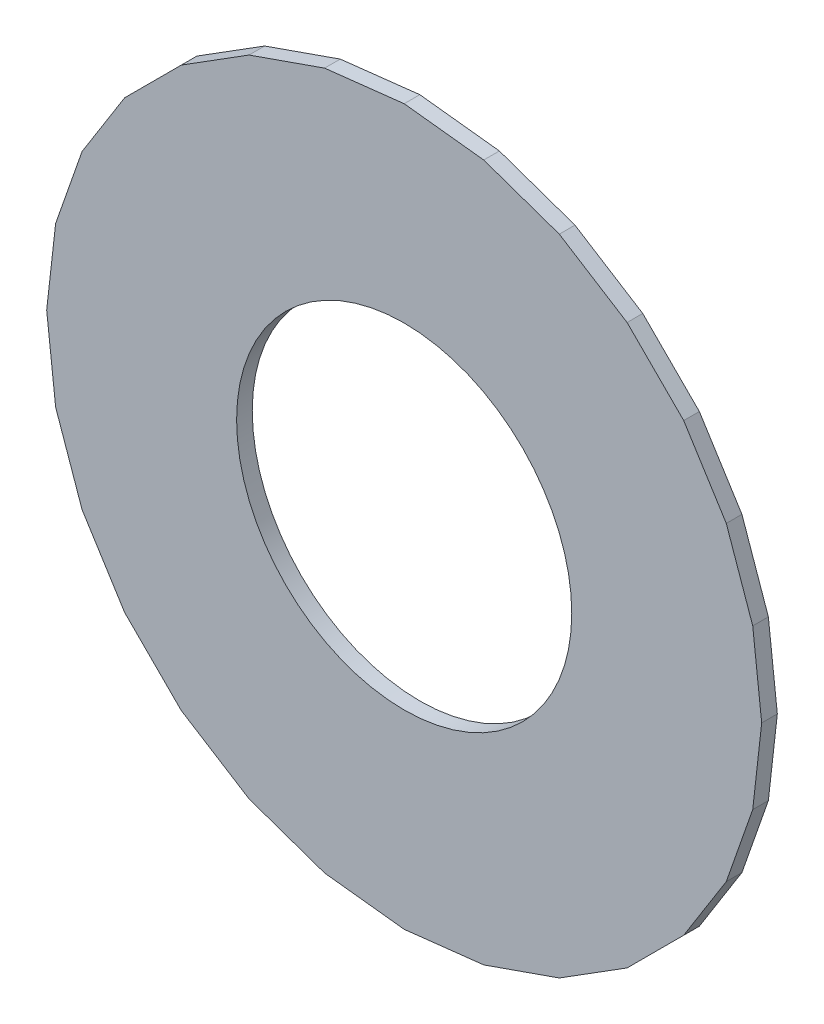
ISO-10303-21;
HEADER;
FILE_DESCRIPTION(('STEP AP214'),'2;1');
FILE_NAME('part.step','',(''),(''),'','','');
FILE_SCHEMA(('AUTOMOTIVE_DESIGN { 1 0 10303 214 1 1 1 1 }'));
ENDSEC;
DATA;
#1=APPLICATION_CONTEXT('core data for automotive mechanical design processes');
#2=APPLICATION_PROTOCOL_DEFINITION('international standard','automotive_design',2000,#1);
#3=PRODUCT_CONTEXT('',#1,'mechanical');
#4=PRODUCT('Part','Part','',(#3));
#5=PRODUCT_RELATED_PRODUCT_CATEGORY('part','',(#4));
#6=PRODUCT_DEFINITION_FORMATION('','',#4);
#7=PRODUCT_DEFINITION_CONTEXT('part definition',#1,'design');
#8=PRODUCT_DEFINITION('design','',#6,#7);
#9=PRODUCT_DEFINITION_SHAPE('','',#8);
#10=(LENGTH_UNIT() NAMED_UNIT(*) SI_UNIT(.MILLI.,.METRE.));
#11=(NAMED_UNIT(*) PLANE_ANGLE_UNIT() SI_UNIT($,.RADIAN.));
#12=(NAMED_UNIT(*) SI_UNIT($,.STERADIAN.) SOLID_ANGLE_UNIT());
#13=UNCERTAINTY_MEASURE_WITH_UNIT(LENGTH_MEASURE(1.E-05),#10,'distance_accuracy_value','');
#14=(GEOMETRIC_REPRESENTATION_CONTEXT(3) GLOBAL_UNCERTAINTY_ASSIGNED_CONTEXT((#13)) GLOBAL_UNIT_ASSIGNED_CONTEXT((#10,
#11,#12)) REPRESENTATION_CONTEXT('',''));
#15=CARTESIAN_POINT('',(0.,0.,0.));
#16=DIRECTION('',(0.,0.,1.));
#17=DIRECTION('',(1.,0.,0.));
#18=AXIS2_PLACEMENT_3D('',#15,#16,#17);
#19=CARTESIAN_POINT('',(165.608,-76.2,-0.045));
#20=DIRECTION('',(0.,0.,-1.));
#21=DIRECTION('',(0.,-1.,0.));
#22=AXIS2_PLACEMENT_3D('',#19,#20,#21);
#23=CYLINDRICAL_SURFACE('',#22,0.375);
#24=CARTESIAN_POINT('',(165.608,-76.2,1.67));
#25=DIRECTION('',(0.,0.,-1.));
#26=DIRECTION('',(0.,-1.,0.));
#27=AXIS2_PLACEMENT_3D('',#24,#25,#26);
#28=CIRCLE('',#27,0.375);
#29=CARTESIAN_POINT('',(165.608,-76.575,1.67));
#30=VERTEX_POINT('',#29);
#31=EDGE_CURVE('E316',#30,#30,#28,.T.);
#32=ORIENTED_EDGE('',*,*,#31,.T.);
#33=DIRECTION('',(0.,0.,1.));
#34=VECTOR('',#33,1.);
#35=CARTESIAN_POINT('',(165.608,-76.575,-0.045));
#36=LINE('',#35,#34);
#37=CARTESIAN_POINT('',(165.608,-76.575,1.705));
#38=VERTEX_POINT('',#37);
#39=EDGE_CURVE('E10',#30,#38,#36,.T.);
#40=ORIENTED_EDGE('',*,*,#39,.T.);
#41=CARTESIAN_POINT('',(165.608,-76.2,1.705));
#42=DIRECTION('',(0.,0.,-1.));
#43=DIRECTION('',(0.,-1.,0.));
#44=AXIS2_PLACEMENT_3D('',#41,#42,#43);
#45=CIRCLE('',#44,0.375);
#46=EDGE_CURVE('E283',#38,#38,#45,.T.);
#47=ORIENTED_EDGE('',*,*,#46,.F.);
#48=ORIENTED_EDGE('',*,*,#39,.F.);
#49=EDGE_LOOP('',(#32,#40,#47,#48));
#50=FACE_BOUND('',#49,.T.);
#51=ADVANCED_FACE('F16',(#50),#23,.F.);
#52=CARTESIAN_POINT('',(165.429983,-76.979942,1.67));
#53=DIRECTION('',(-0.330278315977027,-0.943883591337077,0.));
#54=DIRECTION('',(-0.943883591337077,0.330278315977027,0.));
#55=AXIS2_PLACEMENT_3D('',#52,#53,#54);
#56=PLANE('',#55);
#57=DIRECTION('',(0.,0.,1.));
#58=VECTOR('',#57,1.);
#59=CARTESIAN_POINT('',(165.429983,-76.979942,1.67));
#60=LINE('',#59,#58);
#61=CARTESIAN_POINT('',(165.429983,-76.979942,1.67));
#62=VERTEX_POINT('',#61);
#63=CARTESIAN_POINT('',(165.429983,-76.979942,1.705));
#64=VERTEX_POINT('',#63);
#65=EDGE_CURVE('E25',#62,#64,#60,.T.);
#66=ORIENTED_EDGE('',*,*,#65,.T.);
#67=DIRECTION('',(-0.943883591337077,0.330278315977027,0.));
#68=VECTOR('',#67,1.);
#69=CARTESIAN_POINT('',(165.429983,-76.979942,1.705));
#70=LINE('',#69,#68);
#71=CARTESIAN_POINT('',(165.260893,-76.920775,1.705));
#72=VERTEX_POINT('',#71);
#73=EDGE_CURVE('E330',#64,#72,#70,.T.);
#74=ORIENTED_EDGE('',*,*,#73,.T.);
#75=DIRECTION('',(0.,0.,1.));
#76=VECTOR('',#75,1.);
#77=CARTESIAN_POINT('',(165.260893,-76.920775,1.67));
#78=LINE('',#77,#76);
#79=CARTESIAN_POINT('',(165.260893,-76.920775,1.67));
#80=VERTEX_POINT('',#79);
#81=EDGE_CURVE('E19',#80,#72,#78,.T.);
#82=ORIENTED_EDGE('',*,*,#81,.F.);
#83=DIRECTION('',(-0.943883591337077,0.330278315977027,0.));
#84=VECTOR('',#83,1.);
#85=CARTESIAN_POINT('',(165.429983,-76.979942,1.67));
#86=LINE('',#85,#84);
#87=EDGE_CURVE('E420',#62,#80,#86,.T.);
#88=ORIENTED_EDGE('',*,*,#87,.F.);
#89=EDGE_LOOP('',(#66,#74,#82,#88));
#90=FACE_BOUND('',#89,.T.);
#91=ADVANCED_FACE('F880',(#90),#56,.T.);
#92=CARTESIAN_POINT('',(165.608,-77.,1.67));
#93=DIRECTION('',(-0.111966136678988,-0.993712022789894,0.));
#94=DIRECTION('',(-0.993712022789894,0.111966136678988,0.));
#95=AXIS2_PLACEMENT_3D('',#92,#93,#94);
#96=PLANE('',#95);
#97=DIRECTION('',(0.,0.,1.));
#98=VECTOR('',#97,1.);
#99=CARTESIAN_POINT('',(165.608,-77.,1.67));
#100=LINE('',#99,#98);
#101=CARTESIAN_POINT('',(165.608,-77.,1.67));
#102=VERTEX_POINT('',#101);
#103=CARTESIAN_POINT('',(165.608,-77.,1.705));
#104=VERTEX_POINT('',#103);
#105=EDGE_CURVE('E567',#102,#104,#100,.T.);
#106=ORIENTED_EDGE('',*,*,#105,.T.);
#107=DIRECTION('',(-0.993712022789894,0.111966136678988,0.));
#108=VECTOR('',#107,1.);
#109=CARTESIAN_POINT('',(165.608,-77.,1.705));
#110=LINE('',#109,#108);
#111=EDGE_CURVE('E480',#104,#64,#110,.T.);
#112=ORIENTED_EDGE('',*,*,#111,.T.);
#113=ORIENTED_EDGE('',*,*,#65,.F.);
#114=DIRECTION('',(-0.993712022789894,0.111966136678988,0.));
#115=VECTOR('',#114,1.);
#116=CARTESIAN_POINT('',(165.608,-77.,1.67));
#117=LINE('',#116,#115);
#118=EDGE_CURVE('E416',#102,#62,#117,.T.);
#119=ORIENTED_EDGE('',*,*,#118,.F.);
#120=EDGE_LOOP('',(#106,#112,#113,#119));
#121=FACE_BOUND('',#120,.T.);
#122=ADVANCED_FACE('F885',(#121),#96,.T.);
#123=CARTESIAN_POINT('',(165.260893,-76.920775,1.67));
#124=DIRECTION('',(-0.532032066600227,-0.846724205458361,0.));
#125=DIRECTION('',(-0.846724205458361,0.532032066600227,0.));
#126=AXIS2_PLACEMENT_3D('',#123,#124,#125);
#127=PLANE('',#126);
#128=ORIENTED_EDGE('',*,*,#81,.T.);
#129=DIRECTION('',(-0.846724205458361,0.532032066600227,0.));
#130=VECTOR('',#129,1.);
#131=CARTESIAN_POINT('',(165.260893,-76.920775,1.705));
#132=LINE('',#131,#130);
#133=CARTESIAN_POINT('',(165.109208,-76.825465,1.705));
#134=VERTEX_POINT('',#133);
#135=EDGE_CURVE('E326',#72,#134,#132,.T.);
#136=ORIENTED_EDGE('',*,*,#135,.T.);
#137=DIRECTION('',(0.,0.,1.));
#138=VECTOR('',#137,1.);
#139=CARTESIAN_POINT('',(165.109208,-76.825465,1.67));
#140=LINE('',#139,#138);
#141=CARTESIAN_POINT('',(165.109208,-76.825465,1.67));
#142=VERTEX_POINT('',#141);
#143=EDGE_CURVE('E570',#142,#134,#140,.T.);
#144=ORIENTED_EDGE('',*,*,#143,.F.);
#145=DIRECTION('',(-0.846724205458361,0.532032066600227,0.));
#146=VECTOR('',#145,1.);
#147=CARTESIAN_POINT('',(165.260893,-76.920775,1.67));
#148=LINE('',#147,#146);
#149=EDGE_CURVE('E430',#80,#142,#148,.T.);
#150=ORIENTED_EDGE('',*,*,#149,.F.);
#151=EDGE_LOOP('',(#128,#136,#144,#150));
#152=FACE_BOUND('',#151,.T.);
#153=ADVANCED_FACE('F587',(#152),#127,.T.);
#154=CARTESIAN_POINT('',(165.786017,-76.979942,1.67));
#155=DIRECTION('',(0.111966136678988,-0.993712022789894,0.));
#156=DIRECTION('',(0.,0.,-1.));
#157=AXIS2_PLACEMENT_3D('',#154,#155,#156);
#158=PLANE('',#157);
#159=DIRECTION('',(0.,0.,1.));
#160=VECTOR('',#159,1.);
#161=CARTESIAN_POINT('',(165.786017,-76.979942,1.67));
#162=LINE('',#161,#160);
#163=CARTESIAN_POINT('',(165.786017,-76.979942,1.67));
#164=VERTEX_POINT('',#163);
#165=CARTESIAN_POINT('',(165.786017,-76.979942,1.705));
#166=VERTEX_POINT('',#165);
#167=EDGE_CURVE('E573',#164,#166,#162,.T.);
#168=ORIENTED_EDGE('',*,*,#167,.T.);
#169=DIRECTION('',(-0.993712022789894,-0.111966136678988,0.));
#170=VECTOR('',#169,1.);
#171=CARTESIAN_POINT('',(165.786017,-76.979942,1.705));
#172=LINE('',#171,#170);
#173=EDGE_CURVE('E476',#166,#104,#172,.T.);
#174=ORIENTED_EDGE('',*,*,#173,.T.);
#175=ORIENTED_EDGE('',*,*,#105,.F.);
#176=DIRECTION('',(-0.993712022789894,-0.111966136678988,0.));
#177=VECTOR('',#176,1.);
#178=CARTESIAN_POINT('',(165.786017,-76.979942,1.67));
#179=LINE('',#178,#177);
#180=EDGE_CURVE('E412',#164,#102,#179,.T.);
#181=ORIENTED_EDGE('',*,*,#180,.F.);
#182=EDGE_LOOP('',(#168,#174,#175,#181));
#183=FACE_BOUND('',#182,.T.);
#184=ADVANCED_FACE('F1105',(#183),#158,.T.);
#185=CARTESIAN_POINT('',(165.109208,-76.825465,1.67));
#186=DIRECTION('',(-0.707106781186548,-0.707106781186548,0.));
#187=DIRECTION('',(-0.707106781186548,0.707106781186548,0.));
#188=AXIS2_PLACEMENT_3D('',#185,#186,#187);
#189=PLANE('',#188);
#190=ORIENTED_EDGE('',*,*,#143,.T.);
#191=DIRECTION('',(-0.707106781186548,0.707106781186548,0.));
#192=VECTOR('',#191,1.);
#193=CARTESIAN_POINT('',(165.109208,-76.825465,1.705));
#194=LINE('',#193,#192);
#195=CARTESIAN_POINT('',(164.982535,-76.698792,1.705));
#196=VERTEX_POINT('',#195);
#197=EDGE_CURVE('E331',#134,#196,#194,.T.);
#198=ORIENTED_EDGE('',*,*,#197,.T.);
#199=DIRECTION('',(0.,0.,1.));
#200=VECTOR('',#199,1.);
#201=CARTESIAN_POINT('',(164.982535,-76.698792,1.67));
#202=LINE('',#201,#200);
#203=CARTESIAN_POINT('',(164.982535,-76.698792,1.67));
#204=VERTEX_POINT('',#203);
#205=EDGE_CURVE('E566',#204,#196,#202,.T.);
#206=ORIENTED_EDGE('',*,*,#205,.F.);
#207=DIRECTION('',(-0.707106781186548,0.707106781186548,0.));
#208=VECTOR('',#207,1.);
#209=CARTESIAN_POINT('',(165.109208,-76.825465,1.67));
#210=LINE('',#209,#208);
#211=EDGE_CURVE('E310',#142,#204,#210,.T.);
#212=ORIENTED_EDGE('',*,*,#211,.F.);
#213=EDGE_LOOP('',(#190,#198,#206,#212));
#214=FACE_BOUND('',#213,.T.);
#215=ADVANCED_FACE('F580',(#214),#189,.T.);
#216=CARTESIAN_POINT('',(165.955107,-76.920775,1.67));
#217=DIRECTION('',(0.330278315977027,-0.943883591337077,0.));
#218=DIRECTION('',(0.,0.,-1.));
#219=AXIS2_PLACEMENT_3D('',#216,#217,#218);
#220=PLANE('',#219);
#221=DIRECTION('',(0.,0.,1.));
#222=VECTOR('',#221,1.);
#223=CARTESIAN_POINT('',(165.955107,-76.920775,1.67));
#224=LINE('',#223,#222);
#225=CARTESIAN_POINT('',(165.955107,-76.920775,1.67));
#226=VERTEX_POINT('',#225);
#227=CARTESIAN_POINT('',(165.955107,-76.920775,1.705));
#228=VERTEX_POINT('',#227);
#229=EDGE_CURVE('E563',#226,#228,#224,.T.);
#230=ORIENTED_EDGE('',*,*,#229,.T.);
#231=DIRECTION('',(-0.943883591337077,-0.330278315977027,0.));
#232=VECTOR('',#231,1.);
#233=CARTESIAN_POINT('',(165.955107,-76.920775,1.705));
#234=LINE('',#233,#232);
#235=EDGE_CURVE('E346',#228,#166,#234,.T.);
#236=ORIENTED_EDGE('',*,*,#235,.T.);
#237=ORIENTED_EDGE('',*,*,#167,.F.);
#238=DIRECTION('',(-0.943883591337077,-0.330278315977027,0.));
#239=VECTOR('',#238,1.);
#240=CARTESIAN_POINT('',(165.955107,-76.920775,1.67));
#241=LINE('',#240,#239);
#242=EDGE_CURVE('E405',#226,#164,#241,.T.);
#243=ORIENTED_EDGE('',*,*,#242,.F.);
#244=EDGE_LOOP('',(#230,#236,#237,#243));
#245=FACE_BOUND('',#244,.T.);
#246=ADVANCED_FACE('F1090',(#245),#220,.T.);
#247=CARTESIAN_POINT('',(164.982535,-76.698792,1.67));
#248=DIRECTION('',(-0.846724205458361,-0.532032066600227,0.));
#249=DIRECTION('',(-0.532032066600227,0.846724205458361,0.));
#250=AXIS2_PLACEMENT_3D('',#247,#248,#249);
#251=PLANE('',#250);
#252=ORIENTED_EDGE('',*,*,#205,.T.);
#253=DIRECTION('',(-0.532032066600227,0.846724205458361,0.));
#254=VECTOR('',#253,1.);
#255=CARTESIAN_POINT('',(164.982535,-76.698792,1.705));
#256=LINE('',#255,#254);
#257=CARTESIAN_POINT('',(164.887225,-76.547107,1.705));
#258=VERTEX_POINT('',#257);
#259=EDGE_CURVE('E491',#196,#258,#256,.T.);
#260=ORIENTED_EDGE('',*,*,#259,.T.);
#261=DIRECTION('',(0.,0.,1.));
#262=VECTOR('',#261,1.);
#263=CARTESIAN_POINT('',(164.887225,-76.547107,1.67));
#264=LINE('',#263,#262);
#265=CARTESIAN_POINT('',(164.887225,-76.547107,1.67));
#266=VERTEX_POINT('',#265);
#267=EDGE_CURVE('E560',#266,#258,#264,.T.);
#268=ORIENTED_EDGE('',*,*,#267,.F.);
#269=DIRECTION('',(-0.532032066600227,0.846724205458361,0.));
#270=VECTOR('',#269,1.);
#271=CARTESIAN_POINT('',(164.982535,-76.698792,1.67));
#272=LINE('',#271,#270);
#273=EDGE_CURVE('E441',#204,#266,#272,.T.);
#274=ORIENTED_EDGE('',*,*,#273,.F.);
#275=EDGE_LOOP('',(#252,#260,#268,#274));
#276=FACE_BOUND('',#275,.T.);
#277=ADVANCED_FACE('F592',(#276),#251,.T.);
#278=CARTESIAN_POINT('',(166.106792,-76.825465,1.67));
#279=DIRECTION('',(0.532032066600227,-0.846724205458361,0.));
#280=DIRECTION('',(0.,0.,-1.));
#281=AXIS2_PLACEMENT_3D('',#278,#279,#280);
#282=PLANE('',#281);
#283=DIRECTION('',(0.,0.,1.));
#284=VECTOR('',#283,1.);
#285=CARTESIAN_POINT('',(166.106792,-76.825465,1.67));
#286=LINE('',#285,#284);
#287=CARTESIAN_POINT('',(166.106792,-76.825465,1.67));
#288=VERTEX_POINT('',#287);
#289=CARTESIAN_POINT('',(166.106792,-76.825465,1.705));
#290=VERTEX_POINT('',#289);
#291=EDGE_CURVE('E559',#288,#290,#286,.T.);
#292=ORIENTED_EDGE('',*,*,#291,.T.);
#293=DIRECTION('',(-0.846724205458361,-0.532032066600227,0.));
#294=VECTOR('',#293,1.);
#295=CARTESIAN_POINT('',(166.106792,-76.825465,1.705));
#296=LINE('',#295,#294);
#297=EDGE_CURVE('E341',#290,#228,#296,.T.);
#298=ORIENTED_EDGE('',*,*,#297,.T.);
#299=ORIENTED_EDGE('',*,*,#229,.F.);
#300=DIRECTION('',(-0.846724205458361,-0.532032066600227,0.));
#301=VECTOR('',#300,1.);
#302=CARTESIAN_POINT('',(166.106792,-76.825465,1.67));
#303=LINE('',#302,#301);
#304=EDGE_CURVE('E401',#288,#226,#303,.T.);
#305=ORIENTED_EDGE('',*,*,#304,.F.);
#306=EDGE_LOOP('',(#292,#298,#299,#305));
#307=FACE_BOUND('',#306,.T.);
#308=ADVANCED_FACE('F866',(#307),#282,.T.);
#309=CARTESIAN_POINT('',(164.887225,-76.547107,1.67));
#310=DIRECTION('',(-0.943883591337077,-0.330278315977027,0.));
#311=DIRECTION('',(-0.330278315977027,0.943883591337077,0.));
#312=AXIS2_PLACEMENT_3D('',#309,#310,#311);
#313=PLANE('',#312);
#314=ORIENTED_EDGE('',*,*,#267,.T.);
#315=DIRECTION('',(-0.330278315977027,0.943883591337077,0.));
#316=VECTOR('',#315,1.);
#317=CARTESIAN_POINT('',(164.887225,-76.547107,1.705));
#318=LINE('',#317,#316);
#319=CARTESIAN_POINT('',(164.828058,-76.378017,1.705));
#320=VERTEX_POINT('',#319);
#321=EDGE_CURVE('E390',#258,#320,#318,.T.);
#322=ORIENTED_EDGE('',*,*,#321,.T.);
#323=DIRECTION('',(0.,0.,1.));
#324=VECTOR('',#323,1.);
#325=CARTESIAN_POINT('',(164.828058,-76.378017,1.67));
#326=LINE('',#325,#324);
#327=CARTESIAN_POINT('',(164.828058,-76.378017,1.67));
#328=VERTEX_POINT('',#327);
#329=EDGE_CURVE('E556',#328,#320,#326,.T.);
#330=ORIENTED_EDGE('',*,*,#329,.F.);
#331=DIRECTION('',(-0.330278315977027,0.943883591337077,0.));
#332=VECTOR('',#331,1.);
#333=CARTESIAN_POINT('',(164.887225,-76.547107,1.67));
#334=LINE('',#333,#332);
#335=EDGE_CURVE('E445',#266,#328,#334,.T.);
#336=ORIENTED_EDGE('',*,*,#335,.F.);
#337=EDGE_LOOP('',(#314,#322,#330,#336));
#338=FACE_BOUND('',#337,.T.);
#339=ADVANCED_FACE('F863',(#338),#313,.T.);
#340=CARTESIAN_POINT('',(166.233465,-76.698792,1.67));
#341=DIRECTION('',(0.707106781186548,-0.707106781186548,0.));
#342=DIRECTION('',(0.,0.,-1.));
#343=AXIS2_PLACEMENT_3D('',#340,#341,#342);
#344=PLANE('',#343);
#345=DIRECTION('',(0.,0.,1.));
#346=VECTOR('',#345,1.);
#347=CARTESIAN_POINT('',(166.233465,-76.698792,1.67));
#348=LINE('',#347,#346);
#349=CARTESIAN_POINT('',(166.233465,-76.698792,1.67));
#350=VERTEX_POINT('',#349);
#351=CARTESIAN_POINT('',(166.233465,-76.698792,1.705));
#352=VERTEX_POINT('',#351);
#353=EDGE_CURVE('E553',#350,#352,#348,.T.);
#354=ORIENTED_EDGE('',*,*,#353,.T.);
#355=DIRECTION('',(-0.707106781186548,-0.707106781186548,0.));
#356=VECTOR('',#355,1.);
#357=CARTESIAN_POINT('',(166.233465,-76.698792,1.705));
#358=LINE('',#357,#356);
#359=EDGE_CURVE('E345',#352,#290,#358,.T.);
#360=ORIENTED_EDGE('',*,*,#359,.T.);
#361=ORIENTED_EDGE('',*,*,#291,.F.);
#362=DIRECTION('',(-0.707106781186548,-0.707106781186548,0.));
#363=VECTOR('',#362,1.);
#364=CARTESIAN_POINT('',(166.233465,-76.698792,1.67));
#365=LINE('',#364,#363);
#366=EDGE_CURVE('E385',#350,#288,#365,.T.);
#367=ORIENTED_EDGE('',*,*,#366,.F.);
#368=EDGE_LOOP('',(#354,#360,#361,#367));
#369=FACE_BOUND('',#368,.T.);
#370=ADVANCED_FACE('F865',(#369),#344,.T.);
#371=CARTESIAN_POINT('',(164.828058,-76.378017,1.67));
#372=DIRECTION('',(-0.993712022789894,-0.111966136678988,0.));
#373=DIRECTION('',(-0.111966136678988,0.993712022789894,0.));
#374=AXIS2_PLACEMENT_3D('',#371,#372,#373);
#375=PLANE('',#374);
#376=ORIENTED_EDGE('',*,*,#329,.T.);
#377=DIRECTION('',(-0.111966136678988,0.993712022789894,0.));
#378=VECTOR('',#377,1.);
#379=CARTESIAN_POINT('',(164.828058,-76.378017,1.705));
#380=LINE('',#379,#378);
#381=CARTESIAN_POINT('',(164.808,-76.2,1.705));
#382=VERTEX_POINT('',#381);
#383=EDGE_CURVE('E386',#320,#382,#380,.T.);
#384=ORIENTED_EDGE('',*,*,#383,.T.);
#385=DIRECTION('',(0.,0.,1.));
#386=VECTOR('',#385,1.);
#387=CARTESIAN_POINT('',(164.808,-76.2,1.67));
#388=LINE('',#387,#386);
#389=CARTESIAN_POINT('',(164.808,-76.2,1.67));
#390=VERTEX_POINT('',#389);
#391=EDGE_CURVE('E423',#390,#382,#388,.T.);
#392=ORIENTED_EDGE('',*,*,#391,.F.);
#393=DIRECTION('',(-0.111966136678988,0.993712022789894,0.));
#394=VECTOR('',#393,1.);
#395=CARTESIAN_POINT('',(164.828058,-76.378017,1.67));
#396=LINE('',#395,#394);
#397=EDGE_CURVE('E446',#328,#390,#396,.T.);
#398=ORIENTED_EDGE('',*,*,#397,.F.);
#399=EDGE_LOOP('',(#376,#384,#392,#398));
#400=FACE_BOUND('',#399,.T.);
#401=ADVANCED_FACE('F861',(#400),#375,.T.);
#402=CARTESIAN_POINT('',(166.328775,-76.547107,1.67));
#403=DIRECTION('',(0.846724205458361,-0.532032066600227,0.));
#404=DIRECTION('',(0.,0.,-1.));
#405=AXIS2_PLACEMENT_3D('',#402,#403,#404);
#406=PLANE('',#405);
#407=DIRECTION('',(0.,0.,1.));
#408=VECTOR('',#407,1.);
#409=CARTESIAN_POINT('',(166.328775,-76.547107,1.67));
#410=LINE('',#409,#408);
#411=CARTESIAN_POINT('',(166.328775,-76.547107,1.67));
#412=VERTEX_POINT('',#411);
#413=CARTESIAN_POINT('',(166.328775,-76.547107,1.705));
#414=VERTEX_POINT('',#413);
#415=EDGE_CURVE('E408',#412,#414,#410,.T.);
#416=ORIENTED_EDGE('',*,*,#415,.T.);
#417=DIRECTION('',(-0.532032066600227,-0.846724205458361,0.));
#418=VECTOR('',#417,1.);
#419=CARTESIAN_POINT('',(166.328775,-76.547107,1.705));
#420=LINE('',#419,#418);
#421=EDGE_CURVE('E516',#414,#352,#420,.T.);
#422=ORIENTED_EDGE('',*,*,#421,.T.);
#423=ORIENTED_EDGE('',*,*,#353,.F.);
#424=DIRECTION('',(-0.532032066600227,-0.846724205458361,0.));
#425=VECTOR('',#424,1.);
#426=CARTESIAN_POINT('',(166.328775,-76.547107,1.67));
#427=LINE('',#426,#425);
#428=EDGE_CURVE('E355',#412,#350,#427,.T.);
#429=ORIENTED_EDGE('',*,*,#428,.F.);
#430=EDGE_LOOP('',(#416,#422,#423,#429));
#431=FACE_BOUND('',#430,.T.);
#432=ADVANCED_FACE('F943',(#431),#406,.T.);
#433=CARTESIAN_POINT('',(164.808,-76.2,1.67));
#434=DIRECTION('',(-0.993712022789894,0.111966136678988,0.));
#435=DIRECTION('',(0.,0.,1.));
#436=AXIS2_PLACEMENT_3D('',#433,#434,#435);
#437=PLANE('',#436);
#438=ORIENTED_EDGE('',*,*,#391,.T.);
#439=DIRECTION('',(0.111966136678988,0.993712022789894,0.));
#440=VECTOR('',#439,1.);
#441=CARTESIAN_POINT('',(164.808,-76.2,1.705));
#442=LINE('',#441,#440);
#443=CARTESIAN_POINT('',(164.828058,-76.021983,1.705));
#444=VERTEX_POINT('',#443);
#445=EDGE_CURVE('E391',#382,#444,#442,.T.);
#446=ORIENTED_EDGE('',*,*,#445,.T.);
#447=DIRECTION('',(0.,0.,1.));
#448=VECTOR('',#447,1.);
#449=CARTESIAN_POINT('',(164.828058,-76.021983,1.67));
#450=LINE('',#449,#448);
#451=CARTESIAN_POINT('',(164.828058,-76.021983,1.67));
#452=VERTEX_POINT('',#451);
#453=EDGE_CURVE('E324',#452,#444,#450,.T.);
#454=ORIENTED_EDGE('',*,*,#453,.F.);
#455=DIRECTION('',(0.111966136678988,0.993712022789894,0.));
#456=VECTOR('',#455,1.);
#457=CARTESIAN_POINT('',(164.808,-76.2,1.67));
#458=LINE('',#457,#456);
#459=EDGE_CURVE('E450',#390,#452,#458,.T.);
#460=ORIENTED_EDGE('',*,*,#459,.F.);
#461=EDGE_LOOP('',(#438,#446,#454,#460));
#462=FACE_BOUND('',#461,.T.);
#463=ADVANCED_FACE('F858',(#462),#437,.T.);
#464=CARTESIAN_POINT('',(166.387942,-76.378017,1.67));
#465=DIRECTION('',(0.943883591337077,-0.330278315977027,0.));
#466=DIRECTION('',(0.,0.,-1.));
#467=AXIS2_PLACEMENT_3D('',#464,#465,#466);
#468=PLANE('',#467);
#469=DIRECTION('',(0.,0.,1.));
#470=VECTOR('',#469,1.);
#471=CARTESIAN_POINT('',(166.387942,-76.378017,1.67));
#472=LINE('',#471,#470);
#473=CARTESIAN_POINT('',(166.387942,-76.378017,1.67));
#474=VERTEX_POINT('',#473);
#475=CARTESIAN_POINT('',(166.387942,-76.378017,1.705));
#476=VERTEX_POINT('',#475);
#477=EDGE_CURVE('E321',#474,#476,#472,.T.);
#478=ORIENTED_EDGE('',*,*,#477,.T.);
#479=DIRECTION('',(-0.330278315977027,-0.943883591337077,0.));
#480=VECTOR('',#479,1.);
#481=CARTESIAN_POINT('',(166.387942,-76.378017,1.705));
#482=LINE('',#481,#480);
#483=EDGE_CURVE('E520',#476,#414,#482,.T.);
#484=ORIENTED_EDGE('',*,*,#483,.T.);
#485=ORIENTED_EDGE('',*,*,#415,.F.);
#486=DIRECTION('',(-0.330278315977027,-0.943883591337077,0.));
#487=VECTOR('',#486,1.);
#488=CARTESIAN_POINT('',(166.387942,-76.378017,1.67));
#489=LINE('',#488,#487);
#490=EDGE_CURVE('E351',#474,#412,#489,.T.);
#491=ORIENTED_EDGE('',*,*,#490,.F.);
#492=EDGE_LOOP('',(#478,#484,#485,#491));
#493=FACE_BOUND('',#492,.T.);
#494=ADVANCED_FACE('F908',(#493),#468,.T.);
#495=CARTESIAN_POINT('',(164.828058,-76.021983,1.67));
#496=DIRECTION('',(-0.943883591337077,0.330278315977027,0.));
#497=DIRECTION('',(0.,0.,1.));
#498=AXIS2_PLACEMENT_3D('',#495,#496,#497);
#499=PLANE('',#498);
#500=ORIENTED_EDGE('',*,*,#453,.T.);
#501=DIRECTION('',(0.330278315977027,0.943883591337077,0.));
#502=VECTOR('',#501,1.);
#503=CARTESIAN_POINT('',(164.828058,-76.021983,1.705));
#504=LINE('',#503,#502);
#505=CARTESIAN_POINT('',(164.887225,-75.852893,1.705));
#506=VERTEX_POINT('',#505);
#507=EDGE_CURVE('E481',#444,#506,#504,.T.);
#508=ORIENTED_EDGE('',*,*,#507,.T.);
#509=DIRECTION('',(0.,0.,1.));
#510=VECTOR('',#509,1.);
#511=CARTESIAN_POINT('',(164.887225,-75.852893,1.67));
#512=LINE('',#511,#510);
#513=CARTESIAN_POINT('',(164.887225,-75.852893,1.67));
#514=VERTEX_POINT('',#513);
#515=EDGE_CURVE('E325',#514,#506,#512,.T.);
#516=ORIENTED_EDGE('',*,*,#515,.F.);
#517=DIRECTION('',(0.330278315977027,0.943883591337077,0.));
#518=VECTOR('',#517,1.);
#519=CARTESIAN_POINT('',(164.828058,-76.021983,1.67));
#520=LINE('',#519,#518);
#521=EDGE_CURVE('E397',#452,#514,#520,.T.);
#522=ORIENTED_EDGE('',*,*,#521,.F.);
#523=EDGE_LOOP('',(#500,#508,#516,#522));
#524=FACE_BOUND('',#523,.T.);
#525=ADVANCED_FACE('F855',(#524),#499,.T.);
#526=CARTESIAN_POINT('',(166.408,-76.2,1.67));
#527=DIRECTION('',(0.993712022789894,-0.111966136678988,0.));
#528=DIRECTION('',(0.,0.,-1.));
#529=AXIS2_PLACEMENT_3D('',#526,#527,#528);
#530=PLANE('',#529);
#531=DIRECTION('',(0.,0.,1.));
#532=VECTOR('',#531,1.);
#533=CARTESIAN_POINT('',(166.408,-76.2,1.67));
#534=LINE('',#533,#532);
#535=CARTESIAN_POINT('',(166.408,-76.2,1.67));
#536=VERTEX_POINT('',#535);
#537=CARTESIAN_POINT('',(166.408,-76.2,1.705));
#538=VERTEX_POINT('',#537);
#539=EDGE_CURVE('E498',#536,#538,#534,.T.);
#540=ORIENTED_EDGE('',*,*,#539,.T.);
#541=DIRECTION('',(-0.111966136678988,-0.993712022789894,0.));
#542=VECTOR('',#541,1.);
#543=CARTESIAN_POINT('',(166.408,-76.2,1.705));
#544=LINE('',#543,#542);
#545=EDGE_CURVE('E524',#538,#476,#544,.T.);
#546=ORIENTED_EDGE('',*,*,#545,.T.);
#547=ORIENTED_EDGE('',*,*,#477,.F.);
#548=DIRECTION('',(-0.111966136678988,-0.993712022789894,0.));
#549=VECTOR('',#548,1.);
#550=CARTESIAN_POINT('',(166.408,-76.2,1.67));
#551=LINE('',#550,#549);
#552=EDGE_CURVE('E356',#536,#474,#551,.T.);
#553=ORIENTED_EDGE('',*,*,#552,.F.);
#554=EDGE_LOOP('',(#540,#546,#547,#553));
#555=FACE_BOUND('',#554,.T.);
#556=ADVANCED_FACE('F907',(#555),#530,.T.);
#557=CARTESIAN_POINT('',(164.887225,-75.852893,1.67));
#558=DIRECTION('',(-0.846724205458361,0.532032066600227,0.));
#559=DIRECTION('',(0.,0.,1.));
#560=AXIS2_PLACEMENT_3D('',#557,#558,#559);
#561=PLANE('',#560);
#562=ORIENTED_EDGE('',*,*,#515,.T.);
#563=DIRECTION('',(0.532032066600227,0.846724205458361,0.));
#564=VECTOR('',#563,1.);
#565=CARTESIAN_POINT('',(164.887225,-75.852893,1.705));
#566=LINE('',#565,#564);
#567=CARTESIAN_POINT('',(164.982535,-75.701208,1.705));
#568=VERTEX_POINT('',#567);
#569=EDGE_CURVE('E367',#506,#568,#566,.T.);
#570=ORIENTED_EDGE('',*,*,#569,.T.);
#571=DIRECTION('',(0.,0.,1.));
#572=VECTOR('',#571,1.);
#573=CARTESIAN_POINT('',(164.982535,-75.701208,1.67));
#574=LINE('',#573,#572);
#575=CARTESIAN_POINT('',(164.982535,-75.701208,1.67));
#576=VERTEX_POINT('',#575);
#577=EDGE_CURVE('E501',#576,#568,#574,.T.);
#578=ORIENTED_EDGE('',*,*,#577,.F.);
#579=DIRECTION('',(0.532032066600227,0.846724205458361,0.));
#580=VECTOR('',#579,1.);
#581=CARTESIAN_POINT('',(164.887225,-75.852893,1.67));
#582=LINE('',#581,#580);
#583=EDGE_CURVE('E392',#514,#576,#582,.T.);
#584=ORIENTED_EDGE('',*,*,#583,.F.);
#585=EDGE_LOOP('',(#562,#570,#578,#584));
#586=FACE_BOUND('',#585,.T.);
#587=ADVANCED_FACE('F843',(#586),#561,.T.);
#588=CARTESIAN_POINT('',(166.387942,-76.021983,1.67));
#589=DIRECTION('',(0.993712022789894,0.111966136678988,0.));
#590=DIRECTION('',(0.,0.,-1.));
#591=AXIS2_PLACEMENT_3D('',#588,#589,#590);
#592=PLANE('',#591);
#593=DIRECTION('',(0.,0.,1.));
#594=VECTOR('',#593,1.);
#595=CARTESIAN_POINT('',(166.387942,-76.021983,1.67));
#596=LINE('',#595,#594);
#597=CARTESIAN_POINT('',(166.387942,-76.021983,1.67));
#598=VERTEX_POINT('',#597);
#599=CARTESIAN_POINT('',(166.387942,-76.021983,1.705));
#600=VERTEX_POINT('',#599);
#601=EDGE_CURVE('E544',#598,#600,#596,.T.);
#602=ORIENTED_EDGE('',*,*,#601,.T.);
#603=DIRECTION('',(0.111966136678988,-0.993712022789894,0.));
#604=VECTOR('',#603,1.);
#605=CARTESIAN_POINT('',(166.387942,-76.021983,1.705));
#606=LINE('',#605,#604);
#607=EDGE_CURVE('E527',#600,#538,#606,.T.);
#608=ORIENTED_EDGE('',*,*,#607,.T.);
#609=ORIENTED_EDGE('',*,*,#539,.F.);
#610=DIRECTION('',(0.111966136678988,-0.993712022789894,0.));
#611=VECTOR('',#610,1.);
#612=CARTESIAN_POINT('',(166.387942,-76.021983,1.67));
#613=LINE('',#612,#611);
#614=EDGE_CURVE('E339',#598,#536,#613,.T.);
#615=ORIENTED_EDGE('',*,*,#614,.F.);
#616=EDGE_LOOP('',(#602,#608,#609,#615));
#617=FACE_BOUND('',#616,.T.);
#618=ADVANCED_FACE('F931',(#617),#592,.T.);
#619=CARTESIAN_POINT('',(164.982535,-75.701208,1.67));
#620=DIRECTION('',(-0.707106781186548,0.707106781186548,0.));
#621=DIRECTION('',(0.,0.,1.));
#622=AXIS2_PLACEMENT_3D('',#619,#620,#621);
#623=PLANE('',#622);
#624=ORIENTED_EDGE('',*,*,#577,.T.);
#625=DIRECTION('',(0.707106781186548,0.707106781186548,0.));
#626=VECTOR('',#625,1.);
#627=CARTESIAN_POINT('',(164.982535,-75.701208,1.705));
#628=LINE('',#627,#626);
#629=CARTESIAN_POINT('',(165.109208,-75.574535,1.705));
#630=VERTEX_POINT('',#629);
#631=EDGE_CURVE('E363',#568,#630,#628,.T.);
#632=ORIENTED_EDGE('',*,*,#631,.T.);
#633=DIRECTION('',(0.,0.,1.));
#634=VECTOR('',#633,1.);
#635=CARTESIAN_POINT('',(165.109208,-75.574535,1.67));
#636=LINE('',#635,#634);
#637=CARTESIAN_POINT('',(165.109208,-75.574535,1.67));
#638=VERTEX_POINT('',#637);
#639=EDGE_CURVE('E439',#638,#630,#636,.T.);
#640=ORIENTED_EDGE('',*,*,#639,.F.);
#641=DIRECTION('',(0.707106781186548,0.707106781186548,0.));
#642=VECTOR('',#641,1.);
#643=CARTESIAN_POINT('',(164.982535,-75.701208,1.67));
#644=LINE('',#643,#642);
#645=EDGE_CURVE('E396',#576,#638,#644,.T.);
#646=ORIENTED_EDGE('',*,*,#645,.F.);
#647=EDGE_LOOP('',(#624,#632,#640,#646));
#648=FACE_BOUND('',#647,.T.);
#649=ADVANCED_FACE('F850',(#648),#623,.T.);
#650=CARTESIAN_POINT('',(166.328775,-75.852893,1.67));
#651=DIRECTION('',(0.943883591337077,0.330278315977027,0.));
#652=DIRECTION('',(0.,0.,-1.));
#653=AXIS2_PLACEMENT_3D('',#650,#651,#652);
#654=PLANE('',#653);
#655=DIRECTION('',(0.,0.,1.));
#656=VECTOR('',#655,1.);
#657=CARTESIAN_POINT('',(166.328775,-75.852893,1.67));
#658=LINE('',#657,#656);
#659=CARTESIAN_POINT('',(166.328775,-75.852893,1.67));
#660=VERTEX_POINT('',#659);
#661=CARTESIAN_POINT('',(166.328775,-75.852893,1.705));
#662=VERTEX_POINT('',#661);
#663=EDGE_CURVE('E436',#660,#662,#658,.T.);
#664=ORIENTED_EDGE('',*,*,#663,.T.);
#665=DIRECTION('',(0.330278315977027,-0.943883591337077,0.));
#666=VECTOR('',#665,1.);
#667=CARTESIAN_POINT('',(166.328775,-75.852893,1.705));
#668=LINE('',#667,#666);
#669=EDGE_CURVE('E529',#662,#600,#668,.T.);
#670=ORIENTED_EDGE('',*,*,#669,.T.);
#671=ORIENTED_EDGE('',*,*,#601,.F.);
#672=DIRECTION('',(0.330278315977027,-0.943883591337077,0.));
#673=VECTOR('',#672,1.);
#674=CARTESIAN_POINT('',(166.328775,-75.852893,1.67));
#675=LINE('',#674,#673);
#676=EDGE_CURVE('E335',#660,#598,#675,.T.);
#677=ORIENTED_EDGE('',*,*,#676,.F.);
#678=EDGE_LOOP('',(#664,#670,#671,#677));
#679=FACE_BOUND('',#678,.T.);
#680=ADVANCED_FACE('F925',(#679),#654,.T.);
#681=CARTESIAN_POINT('',(165.109208,-75.574535,1.67));
#682=DIRECTION('',(-0.532032066600227,0.846724205458361,0.));
#683=DIRECTION('',(0.,0.,1.));
#684=AXIS2_PLACEMENT_3D('',#681,#682,#683);
#685=PLANE('',#684);
#686=ORIENTED_EDGE('',*,*,#639,.T.);
#687=DIRECTION('',(0.846724205458361,0.532032066600227,0.));
#688=VECTOR('',#687,1.);
#689=CARTESIAN_POINT('',(165.109208,-75.574535,1.705));
#690=LINE('',#689,#688);
#691=CARTESIAN_POINT('',(165.260893,-75.479225,1.705));
#692=VERTEX_POINT('',#691);
#693=EDGE_CURVE('E368',#630,#692,#690,.T.);
#694=ORIENTED_EDGE('',*,*,#693,.T.);
#695=DIRECTION('',(0.,0.,1.));
#696=VECTOR('',#695,1.);
#697=CARTESIAN_POINT('',(165.260893,-75.479225,1.67));
#698=LINE('',#697,#696);
#699=CARTESIAN_POINT('',(165.260893,-75.479225,1.67));
#700=VERTEX_POINT('',#699);
#701=EDGE_CURVE('E440',#700,#692,#698,.T.);
#702=ORIENTED_EDGE('',*,*,#701,.F.);
#703=DIRECTION('',(0.846724205458361,0.532032066600227,0.));
#704=VECTOR('',#703,1.);
#705=CARTESIAN_POINT('',(165.109208,-75.574535,1.67));
#706=LINE('',#705,#704);
#707=EDGE_CURVE('E460',#638,#700,#706,.T.);
#708=ORIENTED_EDGE('',*,*,#707,.F.);
#709=EDGE_LOOP('',(#686,#694,#702,#708));
#710=FACE_BOUND('',#709,.T.);
#711=ADVANCED_FACE('F904',(#710),#685,.T.);
#712=CARTESIAN_POINT('',(166.233465,-75.701208,1.67));
#713=DIRECTION('',(0.846724205458361,0.532032066600227,0.));
#714=DIRECTION('',(0.,0.,-1.));
#715=AXIS2_PLACEMENT_3D('',#712,#713,#714);
#716=PLANE('',#715);
#717=DIRECTION('',(0.,0.,1.));
#718=VECTOR('',#717,1.);
#719=CARTESIAN_POINT('',(166.233465,-75.701208,1.67));
#720=LINE('',#719,#718);
#721=CARTESIAN_POINT('',(166.233465,-75.701208,1.67));
#722=VERTEX_POINT('',#721);
#723=CARTESIAN_POINT('',(166.233465,-75.701208,1.705));
#724=VERTEX_POINT('',#723);
#725=EDGE_CURVE('E46',#722,#724,#720,.T.);
#726=ORIENTED_EDGE('',*,*,#725,.T.);
#727=DIRECTION('',(0.532032066600227,-0.846724205458361,0.));
#728=VECTOR('',#727,1.);
#729=CARTESIAN_POINT('',(166.233465,-75.701208,1.705));
#730=LINE('',#729,#728);
#731=EDGE_CURVE('E280',#724,#662,#730,.T.);
#732=ORIENTED_EDGE('',*,*,#731,.T.);
#733=ORIENTED_EDGE('',*,*,#663,.F.);
#734=DIRECTION('',(0.532032066600227,-0.846724205458361,0.));
#735=VECTOR('',#734,1.);
#736=CARTESIAN_POINT('',(166.233465,-75.701208,1.67));
#737=LINE('',#736,#735);
#738=EDGE_CURVE('E340',#722,#660,#737,.T.);
#739=ORIENTED_EDGE('',*,*,#738,.F.);
#740=EDGE_LOOP('',(#726,#732,#733,#739));
#741=FACE_BOUND('',#740,.T.);
#742=ADVANCED_FACE('F913',(#741),#716,.T.);
#743=CARTESIAN_POINT('',(165.260893,-75.479225,1.67));
#744=DIRECTION('',(-0.330278315977918,0.943883591336766,0.));
#745=DIRECTION('',(0.,0.,1.));
#746=AXIS2_PLACEMENT_3D('',#743,#744,#745);
#747=PLANE('',#746);
#748=ORIENTED_EDGE('',*,*,#701,.T.);
#749=DIRECTION('',(0.943883591336766,0.330278315977918,0.));
#750=VECTOR('',#749,1.);
#751=CARTESIAN_POINT('',(165.260893,-75.479225,1.705));
#752=LINE('',#751,#750);
#753=CARTESIAN_POINT('',(165.429983,-75.420058,1.705));
#754=VERTEX_POINT('',#753);
#755=EDGE_CURVE('E315',#692,#754,#752,.T.);
#756=ORIENTED_EDGE('',*,*,#755,.T.);
#757=DIRECTION('',(0.,0.,1.));
#758=VECTOR('',#757,1.);
#759=CARTESIAN_POINT('',(165.429983,-75.420058,1.67));
#760=LINE('',#759,#758);
#761=CARTESIAN_POINT('',(165.429983,-75.420058,1.67));
#762=VERTEX_POINT('',#761);
#763=EDGE_CURVE('E424',#762,#754,#760,.T.);
#764=ORIENTED_EDGE('',*,*,#763,.F.);
#765=DIRECTION('',(0.943883591336766,0.330278315977918,0.));
#766=VECTOR('',#765,1.);
#767=CARTESIAN_POINT('',(165.260893,-75.479225,1.67));
#768=LINE('',#767,#766);
#769=EDGE_CURVE('E464',#700,#762,#768,.T.);
#770=ORIENTED_EDGE('',*,*,#769,.F.);
#771=EDGE_LOOP('',(#748,#756,#764,#770));
#772=FACE_BOUND('',#771,.T.);
#773=ADVANCED_FACE('F910',(#772),#747,.T.);
#774=CARTESIAN_POINT('',(166.106792,-75.574535,1.67));
#775=DIRECTION('',(0.707106781186548,0.707106781186548,0.));
#776=DIRECTION('',(0.,0.,-1.));
#777=AXIS2_PLACEMENT_3D('',#774,#775,#776);
#778=PLANE('',#777);
#779=DIRECTION('',(0.,0.,1.));
#780=VECTOR('',#779,1.);
#781=CARTESIAN_POINT('',(166.106792,-75.574535,1.67));
#782=LINE('',#781,#780);
#783=CARTESIAN_POINT('',(166.106792,-75.574535,1.67));
#784=VERTEX_POINT('',#783);
#785=CARTESIAN_POINT('',(166.106792,-75.574535,1.705));
#786=VERTEX_POINT('',#785);
#787=EDGE_CURVE('E286',#784,#786,#782,.T.);
#788=ORIENTED_EDGE('',*,*,#787,.T.);
#789=DIRECTION('',(0.707106781186548,-0.707106781186548,0.));
#790=VECTOR('',#789,1.);
#791=CARTESIAN_POINT('',(166.106792,-75.574535,1.705));
#792=LINE('',#791,#790);
#793=EDGE_CURVE('E272',#786,#724,#792,.T.);
#794=ORIENTED_EDGE('',*,*,#793,.T.);
#795=ORIENTED_EDGE('',*,*,#725,.F.);
#796=DIRECTION('',(0.707106781186548,-0.707106781186548,0.));
#797=VECTOR('',#796,1.);
#798=CARTESIAN_POINT('',(166.106792,-75.574535,1.67));
#799=LINE('',#798,#797);
#800=EDGE_CURVE('E289',#784,#722,#799,.T.);
#801=ORIENTED_EDGE('',*,*,#800,.F.);
#802=EDGE_LOOP('',(#788,#794,#795,#801));
#803=FACE_BOUND('',#802,.T.);
#804=ADVANCED_FACE('F287',(#803),#778,.T.);
#805=CARTESIAN_POINT('',(165.429983,-75.420058,1.67));
#806=DIRECTION('',(-0.111966136678988,0.993712022789894,0.));
#807=DIRECTION('',(0.,0.,1.));
#808=AXIS2_PLACEMENT_3D('',#805,#806,#807);
#809=PLANE('',#808);
#810=ORIENTED_EDGE('',*,*,#763,.T.);
#811=DIRECTION('',(0.993712022789894,0.111966136678988,0.));
#812=VECTOR('',#811,1.);
#813=CARTESIAN_POINT('',(165.429983,-75.420058,1.705));
#814=LINE('',#813,#812);
#815=CARTESIAN_POINT('',(165.608,-75.4,1.705));
#816=VERTEX_POINT('',#815);
#817=EDGE_CURVE('E312',#754,#816,#814,.T.);
#818=ORIENTED_EDGE('',*,*,#817,.T.);
#819=DIRECTION('',(0.,0.,1.));
#820=VECTOR('',#819,1.);
#821=CARTESIAN_POINT('',(165.608,-75.4,1.67));
#822=LINE('',#821,#820);
#823=CARTESIAN_POINT('',(165.608,-75.4,1.67));
#824=VERTEX_POINT('',#823);
#825=EDGE_CURVE('E350',#824,#816,#822,.T.);
#826=ORIENTED_EDGE('',*,*,#825,.F.);
#827=DIRECTION('',(0.993712022789894,0.111966136678988,0.));
#828=VECTOR('',#827,1.);
#829=CARTESIAN_POINT('',(165.429983,-75.420058,1.67));
#830=LINE('',#829,#828);
#831=EDGE_CURVE('E468',#762,#824,#830,.T.);
#832=ORIENTED_EDGE('',*,*,#831,.F.);
#833=EDGE_LOOP('',(#810,#818,#826,#832));
#834=FACE_BOUND('',#833,.T.);
#835=ADVANCED_FACE('F899',(#834),#809,.T.);
#836=CARTESIAN_POINT('',(0.,0.,1.705));
#837=DIRECTION('',(0.,0.,1.));
#838=DIRECTION('',(1.,0.,0.));
#839=AXIS2_PLACEMENT_3D('',#836,#837,#838);
#840=PLANE('',#839);
#841=ORIENTED_EDGE('',*,*,#46,.T.);
#842=EDGE_LOOP('',(#841));
#843=FACE_BOUND('',#842,.T.);
#844=DIRECTION('',(0.943883591337077,-0.330278315977027,0.));
#845=VECTOR('',#844,1.);
#846=CARTESIAN_POINT('',(165.786017,-75.420058,1.705));
#847=LINE('',#846,#845);
#848=CARTESIAN_POINT('',(165.786017,-75.420058,1.705));
#849=VERTEX_POINT('',#848);
#850=CARTESIAN_POINT('',(165.955107,-75.479225,1.705));
#851=VERTEX_POINT('',#850);
#852=EDGE_CURVE('E317',#849,#851,#847,.T.);
#853=ORIENTED_EDGE('',*,*,#852,.F.);
#854=DIRECTION('',(0.993712022789894,-0.111966136678988,0.));
#855=VECTOR('',#854,1.);
#856=CARTESIAN_POINT('',(165.608,-75.4,1.705));
#857=LINE('',#856,#855);
#858=EDGE_CURVE('E306',#816,#849,#857,.T.);
#859=ORIENTED_EDGE('',*,*,#858,.F.);
#860=ORIENTED_EDGE('',*,*,#817,.F.);
#861=ORIENTED_EDGE('',*,*,#755,.F.);
#862=ORIENTED_EDGE('',*,*,#693,.F.);
#863=ORIENTED_EDGE('',*,*,#631,.F.);
#864=ORIENTED_EDGE('',*,*,#569,.F.);
#865=ORIENTED_EDGE('',*,*,#507,.F.);
#866=ORIENTED_EDGE('',*,*,#445,.F.);
#867=ORIENTED_EDGE('',*,*,#383,.F.);
#868=ORIENTED_EDGE('',*,*,#321,.F.);
#869=ORIENTED_EDGE('',*,*,#259,.F.);
#870=ORIENTED_EDGE('',*,*,#197,.F.);
#871=ORIENTED_EDGE('',*,*,#135,.F.);
#872=ORIENTED_EDGE('',*,*,#73,.F.);
#873=ORIENTED_EDGE('',*,*,#111,.F.);
#874=ORIENTED_EDGE('',*,*,#173,.F.);
#875=ORIENTED_EDGE('',*,*,#235,.F.);
#876=ORIENTED_EDGE('',*,*,#297,.F.);
#877=ORIENTED_EDGE('',*,*,#359,.F.);
#878=ORIENTED_EDGE('',*,*,#421,.F.);
#879=ORIENTED_EDGE('',*,*,#483,.F.);
#880=ORIENTED_EDGE('',*,*,#545,.F.);
#881=ORIENTED_EDGE('',*,*,#607,.F.);
#882=ORIENTED_EDGE('',*,*,#669,.F.);
#883=ORIENTED_EDGE('',*,*,#731,.F.);
#884=ORIENTED_EDGE('',*,*,#793,.F.);
#885=DIRECTION('',(0.846724205458361,-0.532032066600227,0.));
#886=VECTOR('',#885,1.);
#887=CARTESIAN_POINT('',(165.955107,-75.479225,1.705));
#888=LINE('',#887,#886);
#889=EDGE_CURVE('E277',#851,#786,#888,.T.);
#890=ORIENTED_EDGE('',*,*,#889,.F.);
#891=EDGE_LOOP('',(#853,#859,#860,#861,#862,#863,#864,#865,#866,#867,#868,#869,#870,#871,#872,
#873,#874,#875,#876,#877,#878,#879,#880,#881,#882,#883,#884,#890));
#892=FACE_BOUND('',#891,.T.);
#893=ADVANCED_FACE('F275',(#843,#892),#840,.T.);
#894=CARTESIAN_POINT('',(0.,0.,1.67));
#895=DIRECTION('',(0.,0.,1.));
#896=DIRECTION('',(1.,0.,0.));
#897=AXIS2_PLACEMENT_3D('',#894,#895,#896);
#898=PLANE('',#897);
#899=ORIENTED_EDGE('',*,*,#31,.F.);
#900=EDGE_LOOP('',(#899));
#901=FACE_BOUND('',#900,.T.);
#902=DIRECTION('',(0.846724205458361,-0.532032066600227,0.));
#903=VECTOR('',#902,1.);
#904=CARTESIAN_POINT('',(165.955107,-75.479225,1.67));
#905=LINE('',#904,#903);
#906=CARTESIAN_POINT('',(165.955107,-75.479225,1.67));
#907=VERTEX_POINT('',#906);
#908=EDGE_CURVE('E293',#907,#784,#905,.T.);
#909=ORIENTED_EDGE('',*,*,#908,.T.);
#910=ORIENTED_EDGE('',*,*,#800,.T.);
#911=ORIENTED_EDGE('',*,*,#738,.T.);
#912=ORIENTED_EDGE('',*,*,#676,.T.);
#913=ORIENTED_EDGE('',*,*,#614,.T.);
#914=ORIENTED_EDGE('',*,*,#552,.T.);
#915=ORIENTED_EDGE('',*,*,#490,.T.);
#916=ORIENTED_EDGE('',*,*,#428,.T.);
#917=ORIENTED_EDGE('',*,*,#366,.T.);
#918=ORIENTED_EDGE('',*,*,#304,.T.);
#919=ORIENTED_EDGE('',*,*,#242,.T.);
#920=ORIENTED_EDGE('',*,*,#180,.T.);
#921=ORIENTED_EDGE('',*,*,#118,.T.);
#922=ORIENTED_EDGE('',*,*,#87,.T.);
#923=ORIENTED_EDGE('',*,*,#149,.T.);
#924=ORIENTED_EDGE('',*,*,#211,.T.);
#925=ORIENTED_EDGE('',*,*,#273,.T.);
#926=ORIENTED_EDGE('',*,*,#335,.T.);
#927=ORIENTED_EDGE('',*,*,#397,.T.);
#928=ORIENTED_EDGE('',*,*,#459,.T.);
#929=ORIENTED_EDGE('',*,*,#521,.T.);
#930=ORIENTED_EDGE('',*,*,#583,.T.);
#931=ORIENTED_EDGE('',*,*,#645,.T.);
#932=ORIENTED_EDGE('',*,*,#707,.T.);
#933=ORIENTED_EDGE('',*,*,#769,.T.);
#934=ORIENTED_EDGE('',*,*,#831,.T.);
#935=DIRECTION('',(0.993712022789894,-0.111966136678988,0.));
#936=VECTOR('',#935,1.);
#937=CARTESIAN_POINT('',(165.608,-75.4,1.67));
#938=LINE('',#937,#936);
#939=CARTESIAN_POINT('',(165.786017,-75.420058,1.67));
#940=VERTEX_POINT('',#939);
#941=EDGE_CURVE('E300',#824,#940,#938,.T.);
#942=ORIENTED_EDGE('',*,*,#941,.T.);
#943=DIRECTION('',(0.943883591337077,-0.330278315977027,0.));
#944=VECTOR('',#943,1.);
#945=CARTESIAN_POINT('',(165.786017,-75.420058,1.67));
#946=LINE('',#945,#944);
#947=EDGE_CURVE('E334',#940,#907,#946,.T.);
#948=ORIENTED_EDGE('',*,*,#947,.T.);
#949=EDGE_LOOP('',(#909,#910,#911,#912,#913,#914,#915,#916,#917,#918,#919,#920,#921,#922,#923,
#924,#925,#926,#927,#928,#929,#930,#931,#932,#933,#934,#942,#948));
#950=FACE_BOUND('',#949,.T.);
#951=ADVANCED_FACE('F597',(#901,#950),#898,.F.);
#952=CARTESIAN_POINT('',(165.955107,-75.479225,1.67));
#953=DIRECTION('',(0.532032066600227,0.846724205458361,0.));
#954=DIRECTION('',(0.,0.,-1.));
#955=AXIS2_PLACEMENT_3D('',#952,#953,#954);
#956=PLANE('',#955);
#957=DIRECTION('',(0.,0.,1.));
#958=VECTOR('',#957,1.);
#959=CARTESIAN_POINT('',(165.955107,-75.479225,1.67));
#960=LINE('',#959,#958);
#961=EDGE_CURVE('E297',#907,#851,#960,.T.);
#962=ORIENTED_EDGE('',*,*,#961,.T.);
#963=ORIENTED_EDGE('',*,*,#889,.T.);
#964=ORIENTED_EDGE('',*,*,#787,.F.);
#965=ORIENTED_EDGE('',*,*,#908,.F.);
#966=EDGE_LOOP('',(#962,#963,#964,#965));
#967=FACE_BOUND('',#966,.T.);
#968=ADVANCED_FACE('F295',(#967),#956,.T.);
#969=CARTESIAN_POINT('',(165.608,-75.4,1.67));
#970=DIRECTION('',(0.111966136678988,0.993712022789894,0.));
#971=DIRECTION('',(0.,0.,-1.));
#972=AXIS2_PLACEMENT_3D('',#969,#970,#971);
#973=PLANE('',#972);
#974=ORIENTED_EDGE('',*,*,#825,.T.);
#975=ORIENTED_EDGE('',*,*,#858,.T.);
#976=DIRECTION('',(0.,0.,1.));
#977=VECTOR('',#976,1.);
#978=CARTESIAN_POINT('',(165.786017,-75.420058,1.67));
#979=LINE('',#978,#977);
#980=EDGE_CURVE('E320',#940,#849,#979,.T.);
#981=ORIENTED_EDGE('',*,*,#980,.F.);
#982=ORIENTED_EDGE('',*,*,#941,.F.);
#983=EDGE_LOOP('',(#974,#975,#981,#982));
#984=FACE_BOUND('',#983,.T.);
#985=ADVANCED_FACE('F897',(#984),#973,.T.);
#986=CARTESIAN_POINT('',(165.786017,-75.420058,1.67));
#987=DIRECTION('',(0.330278315977027,0.943883591337077,0.));
#988=DIRECTION('',(0.,0.,-1.));
#989=AXIS2_PLACEMENT_3D('',#986,#987,#988);
#990=PLANE('',#989);
#991=ORIENTED_EDGE('',*,*,#980,.T.);
#992=ORIENTED_EDGE('',*,*,#852,.T.);
#993=ORIENTED_EDGE('',*,*,#961,.F.);
#994=ORIENTED_EDGE('',*,*,#947,.F.);
#995=EDGE_LOOP('',(#991,#992,#993,#994));
#996=FACE_BOUND('',#995,.T.);
#997=ADVANCED_FACE('F1147',(#996),#990,.T.);
#998=CLOSED_SHELL('',(#51,#91,#122,#153,#184,#215,#246,#277,#308,#339,#370,#401,#432,#463,#494,
#525,#556,#587,#618,#649,#680,#711,#742,#773,#804,#835,#893,#951,#968,#985,#997));
#999=MANIFOLD_SOLID_BREP('B1',#998);
#1000=ADVANCED_BREP_SHAPE_REPRESENTATION('',(#18,#999),#14);
#1001=SHAPE_DEFINITION_REPRESENTATION(#9,#1000);
ENDSEC;
END-ISO-10303-21;
